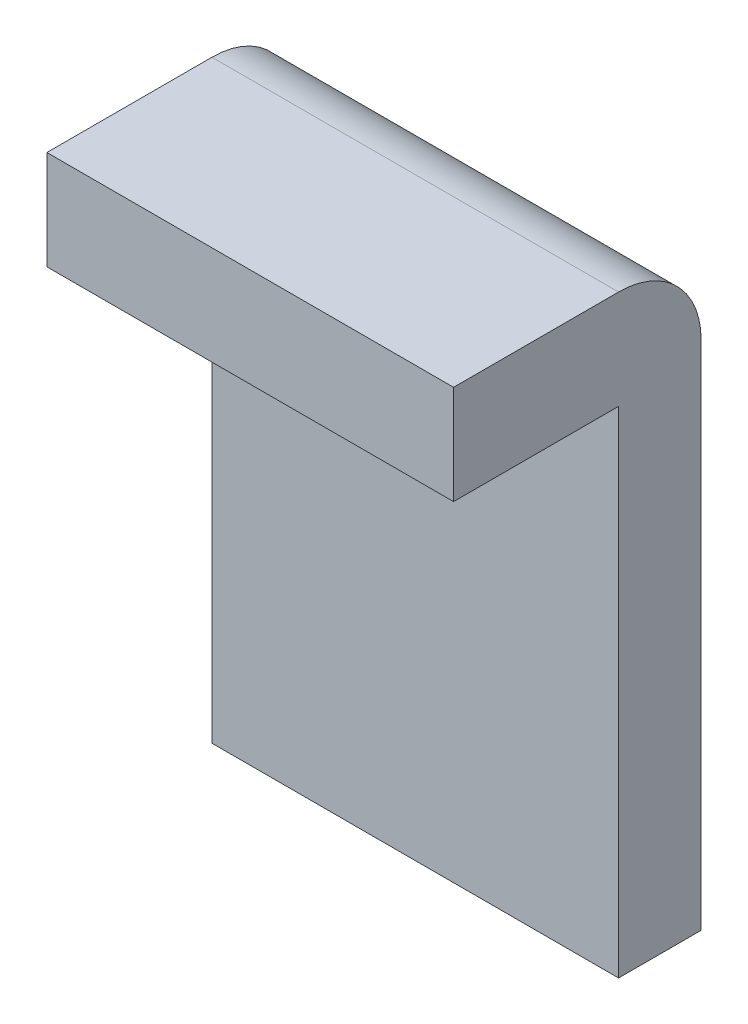
ISO-10303-21;
HEADER;
FILE_DESCRIPTION(('STEP AP214'),'2;1');
FILE_NAME('part.step','',(''),(''),'','','');
FILE_SCHEMA(('AUTOMOTIVE_DESIGN { 1 0 10303 214 1 1 1 1 }'));
ENDSEC;
DATA;
#1=APPLICATION_CONTEXT('core data for automotive mechanical design processes');
#2=APPLICATION_PROTOCOL_DEFINITION('international standard','automotive_design',2000,#1);
#3=PRODUCT_CONTEXT('',#1,'mechanical');
#4=PRODUCT('Part','Part','',(#3));
#5=PRODUCT_RELATED_PRODUCT_CATEGORY('part','',(#4));
#6=PRODUCT_DEFINITION_FORMATION('','',#4);
#7=PRODUCT_DEFINITION_CONTEXT('part definition',#1,'design');
#8=PRODUCT_DEFINITION('design','',#6,#7);
#9=PRODUCT_DEFINITION_SHAPE('','',#8);
#10=(LENGTH_UNIT() NAMED_UNIT(*) SI_UNIT(.MILLI.,.METRE.));
#11=(NAMED_UNIT(*) PLANE_ANGLE_UNIT() SI_UNIT($,.RADIAN.));
#12=(NAMED_UNIT(*) SI_UNIT($,.STERADIAN.) SOLID_ANGLE_UNIT());
#13=UNCERTAINTY_MEASURE_WITH_UNIT(LENGTH_MEASURE(1.E-05),#10,'distance_accuracy_value','');
#14=(GEOMETRIC_REPRESENTATION_CONTEXT(3) GLOBAL_UNCERTAINTY_ASSIGNED_CONTEXT((#13)) GLOBAL_UNIT_ASSIGNED_CONTEXT((#10,
#11,#12)) REPRESENTATION_CONTEXT('',''));
#15=CARTESIAN_POINT('',(0.,0.,0.));
#16=DIRECTION('',(0.,0.,1.));
#17=DIRECTION('',(1.,0.,0.));
#18=AXIS2_PLACEMENT_3D('',#15,#16,#17);
#19=CARTESIAN_POINT('',(-8.34906661620967,8.30000000000001,4.25467377707551));
#20=DIRECTION('',(0.,1.,0.));
#21=DIRECTION('',(0.,0.,1.));
#22=AXIS2_PLACEMENT_3D('',#19,#20,#21);
#23=PLANE('',#22);
#24=DIRECTION('',(1.,0.,0.));
#25=VECTOR('',#24,1.);
#26=CARTESIAN_POINT('',(16.6909354919998,8.30000000000001,4.25467377707551));
#27=LINE('',#26,#25);
#28=CARTESIAN_POINT('',(16.6909354919998,8.30000000000001,4.25467377707551));
#29=VERTEX_POINT('',#28);
#30=CARTESIAN_POINT('',(17.9230862484405,8.30000000000001,4.25467377707551));
#31=VERTEX_POINT('',#30);
#32=EDGE_CURVE('E133',#29,#31,#27,.T.);
#33=ORIENTED_EDGE('',*,*,#32,.F.);
#34=DIRECTION('',(0.,0.,1.));
#35=VECTOR('',#34,1.);
#36=CARTESIAN_POINT('',(16.6909354919998,8.30000000000001,4.25467377707552));
#37=LINE('',#36,#35);
#38=CARTESIAN_POINT('',(16.6909354919998,8.30000000000001,3.75467377707551));
#39=VERTEX_POINT('',#38);
#40=EDGE_CURVE('E113',#39,#29,#37,.T.);
#41=ORIENTED_EDGE('',*,*,#40,.F.);
#42=DIRECTION('',(1.,0.,0.));
#43=VECTOR('',#42,1.);
#44=CARTESIAN_POINT('',(-8.34906661620967,8.30000000000001,3.75467377707551));
#45=LINE('',#44,#43);
#46=CARTESIAN_POINT('',(17.9230862484405,8.30000000000001,3.75467377707551));
#47=VERTEX_POINT('',#46);
#48=EDGE_CURVE('E130',#39,#47,#45,.T.);
#49=ORIENTED_EDGE('',*,*,#48,.T.);
#50=DIRECTION('',(0.,0.,-1.));
#51=VECTOR('',#50,1.);
#52=CARTESIAN_POINT('',(17.9230862484405,8.30000000000001,4.25467377707552));
#53=LINE('',#52,#51);
#54=EDGE_CURVE('E129',#31,#47,#53,.T.);
#55=ORIENTED_EDGE('',*,*,#54,.F.);
#56=EDGE_LOOP('',(#33,#41,#49,#55));
#57=FACE_BOUND('',#56,.T.);
#58=ADVANCED_FACE('F17',(#57),#23,.F.);
#59=CARTESIAN_POINT('',(16.6909354919998,5.35753839337144,4.25467377707552));
#60=DIRECTION('',(0.,0.,1.));
#61=DIRECTION('',(0.,-1.,0.));
#62=AXIS2_PLACEMENT_3D('',#59,#60,#61);
#63=PLANE('',#62);
#64=DIRECTION('',(1.,0.,0.));
#65=VECTOR('',#64,1.);
#66=CARTESIAN_POINT('',(-8.34906661620967,8.6,4.25467377707551));
#67=LINE('',#66,#65);
#68=CARTESIAN_POINT('',(17.9230862484405,8.6,4.25467377707551));
#69=VERTEX_POINT('',#68);
#70=CARTESIAN_POINT('',(16.6909354919998,8.6,4.25467377707551));
#71=VERTEX_POINT('',#70);
#72=EDGE_CURVE('E131',#69,#71,#67,.F.);
#73=ORIENTED_EDGE('',*,*,#72,.T.);
#74=DIRECTION('',(0.,1.,0.));
#75=VECTOR('',#74,1.);
#76=CARTESIAN_POINT('',(16.6909354919998,5.35753839337144,4.25467377707551));
#77=LINE('',#76,#75);
#78=EDGE_CURVE('E136',#29,#71,#77,.T.);
#79=ORIENTED_EDGE('',*,*,#78,.F.);
#80=ORIENTED_EDGE('',*,*,#32,.T.);
#81=DIRECTION('',(0.,1.,0.));
#82=VECTOR('',#81,1.);
#83=CARTESIAN_POINT('',(17.9230862484405,5.35753839337144,4.25467377707551));
#84=LINE('',#83,#82);
#85=EDGE_CURVE('E120',#69,#31,#84,.F.);
#86=ORIENTED_EDGE('',*,*,#85,.F.);
#87=EDGE_LOOP('',(#73,#79,#80,#86));
#88=FACE_BOUND('',#87,.T.);
#89=ADVANCED_FACE('F172',(#88),#63,.T.);
#90=CARTESIAN_POINT('',(-8.34906661620967,8.6,4.25467377707551));
#91=DIRECTION('',(0.,-1.,0.));
#92=DIRECTION('',(0.,0.,-1.));
#93=AXIS2_PLACEMENT_3D('',#90,#91,#92);
#94=PLANE('',#93);
#95=DIRECTION('',(1.,0.,0.));
#96=VECTOR('',#95,1.);
#97=CARTESIAN_POINT('',(-8.34906661620967,8.6,3.75467377707551));
#98=LINE('',#97,#96);
#99=CARTESIAN_POINT('',(16.6909354919998,8.6,3.7546737770755));
#100=VERTEX_POINT('',#99);
#101=CARTESIAN_POINT('',(17.9230862484405,8.6,3.7546737770755));
#102=VERTEX_POINT('',#101);
#103=EDGE_CURVE('E79',#100,#102,#98,.T.);
#104=ORIENTED_EDGE('',*,*,#103,.F.);
#105=DIRECTION('',(0.,0.,1.));
#106=VECTOR('',#105,1.);
#107=CARTESIAN_POINT('',(16.6909354919998,8.6,4.25467377707552));
#108=LINE('',#107,#106);
#109=EDGE_CURVE('E139',#71,#100,#108,.F.);
#110=ORIENTED_EDGE('',*,*,#109,.F.);
#111=ORIENTED_EDGE('',*,*,#72,.F.);
#112=DIRECTION('',(0.,0.,-1.));
#113=VECTOR('',#112,1.);
#114=CARTESIAN_POINT('',(17.9230862484405,8.6,4.25467377707552));
#115=LINE('',#114,#113);
#116=EDGE_CURVE('E83',#102,#69,#115,.F.);
#117=ORIENTED_EDGE('',*,*,#116,.F.);
#118=EDGE_LOOP('',(#104,#110,#111,#117));
#119=FACE_BOUND('',#118,.T.);
#120=ADVANCED_FACE('F169',(#119),#94,.F.);
#121=CARTESIAN_POINT('',(-8.34906661620967,8.30000000000001,3.75467377707551));
#122=DIRECTION('',(0.,0.,-1.));
#123=DIRECTION('',(0.,1.,0.));
#124=AXIS2_PLACEMENT_3D('',#121,#122,#123);
#125=PLANE('',#124);
#126=ORIENTED_EDGE('',*,*,#48,.F.);
#127=DIRECTION('',(0.,1.,0.));
#128=VECTOR('',#127,1.);
#129=CARTESIAN_POINT('',(16.6909354919998,5.35753839337144,3.75467377707551));
#130=LINE('',#129,#128);
#131=CARTESIAN_POINT('',(16.6909354919998,6.8,3.75467377707551));
#132=VERTEX_POINT('',#131);
#133=EDGE_CURVE('E95',#132,#39,#130,.T.);
#134=ORIENTED_EDGE('',*,*,#133,.F.);
#135=DIRECTION('',(1.,0.,0.));
#136=VECTOR('',#135,1.);
#137=CARTESIAN_POINT('',(-15.8147962412963,6.8,3.75467377707551));
#138=LINE('',#137,#136);
#139=CARTESIAN_POINT('',(17.9230862484405,6.8,3.75467377707551));
#140=VERTEX_POINT('',#139);
#141=EDGE_CURVE('E114',#140,#132,#138,.F.);
#142=ORIENTED_EDGE('',*,*,#141,.F.);
#143=DIRECTION('',(0.,1.,0.));
#144=VECTOR('',#143,1.);
#145=CARTESIAN_POINT('',(17.9230862484405,5.35753839337144,3.75467377707551));
#146=LINE('',#145,#144);
#147=EDGE_CURVE('E84',#47,#140,#146,.F.);
#148=ORIENTED_EDGE('',*,*,#147,.F.);
#149=EDGE_LOOP('',(#126,#134,#142,#148));
#150=FACE_BOUND('',#149,.T.);
#151=ADVANCED_FACE('F178',(#150),#125,.F.);
#152=CARTESIAN_POINT('',(-8.34906661620967,8.35,3.7546737770755));
#153=DIRECTION('',(1.,0.,0.));
#154=DIRECTION('',(0.,0.,-1.));
#155=AXIS2_PLACEMENT_3D('',#152,#153,#154);
#156=CYLINDRICAL_SURFACE('',#155,0.249999999999996);
#157=CARTESIAN_POINT('',(16.6909354919997,8.35,3.7546737770755));
#158=DIRECTION('',(1.,0.,0.));
#159=DIRECTION('',(0.,0.,-1.));
#160=AXIS2_PLACEMENT_3D('',#157,#158,#159);
#161=CIRCLE('',#160,0.249999999999996);
#162=CARTESIAN_POINT('',(16.6909354919998,8.35,3.50467377707551));
#163=VERTEX_POINT('',#162);
#164=EDGE_CURVE('E106',#100,#163,#161,.F.);
#165=ORIENTED_EDGE('',*,*,#164,.F.);
#166=ORIENTED_EDGE('',*,*,#103,.T.);
#167=CARTESIAN_POINT('',(17.9230862484405,8.35,3.7546737770755));
#168=DIRECTION('',(1.,0.,0.));
#169=DIRECTION('',(0.,0.,-1.));
#170=AXIS2_PLACEMENT_3D('',#167,#168,#169);
#171=CIRCLE('',#170,0.249999999999996);
#172=CARTESIAN_POINT('',(17.9230862484405,8.35,3.50467377707551));
#173=VERTEX_POINT('',#172);
#174=EDGE_CURVE('E20',#173,#102,#171,.T.);
#175=ORIENTED_EDGE('',*,*,#174,.F.);
#176=DIRECTION('',(1.,0.,0.));
#177=VECTOR('',#176,1.);
#178=CARTESIAN_POINT('',(16.6909354919998,8.35,3.50467377707551));
#179=LINE('',#178,#177);
#180=EDGE_CURVE('E77',#163,#173,#179,.T.);
#181=ORIENTED_EDGE('',*,*,#180,.F.);
#182=EDGE_LOOP('',(#165,#166,#175,#181));
#183=FACE_BOUND('',#182,.T.);
#184=ADVANCED_FACE('F75',(#183),#156,.T.);
#185=CARTESIAN_POINT('',(17.9230862484405,5.35753839337144,4.25467377707552));
#186=DIRECTION('',(1.,0.,0.));
#187=DIRECTION('',(0.,0.,-1.));
#188=AXIS2_PLACEMENT_3D('',#185,#186,#187);
#189=PLANE('',#188);
#190=ORIENTED_EDGE('',*,*,#116,.T.);
#191=ORIENTED_EDGE('',*,*,#85,.T.);
#192=ORIENTED_EDGE('',*,*,#54,.T.);
#193=ORIENTED_EDGE('',*,*,#147,.T.);
#194=DIRECTION('',(0.,0.,-1.));
#195=VECTOR('',#194,1.);
#196=CARTESIAN_POINT('',(17.9230862484405,6.80000000000003,12.5046737770755));
#197=LINE('',#196,#195);
#198=CARTESIAN_POINT('',(17.9230862484405,6.8,3.50467377707552));
#199=VERTEX_POINT('',#198);
#200=EDGE_CURVE('E90',#199,#140,#197,.F.);
#201=ORIENTED_EDGE('',*,*,#200,.F.);
#202=DIRECTION('',(0.,1.,0.));
#203=VECTOR('',#202,1.);
#204=CARTESIAN_POINT('',(17.9230862484405,5.35753839337143,3.50467377707552));
#205=LINE('',#204,#203);
#206=EDGE_CURVE('E86',#173,#199,#205,.F.);
#207=ORIENTED_EDGE('',*,*,#206,.F.);
#208=ORIENTED_EDGE('',*,*,#174,.T.);
#209=EDGE_LOOP('',(#190,#191,#192,#193,#201,#207,#208));
#210=FACE_BOUND('',#209,.T.);
#211=ADVANCED_FACE('F87',(#210),#189,.T.);
#212=CARTESIAN_POINT('',(-15.8147962412963,6.80000000000003,12.5046737770755));
#213=DIRECTION('',(0.,-1.,0.));
#214=DIRECTION('',(0.,0.,-1.));
#215=AXIS2_PLACEMENT_3D('',#212,#213,#214);
#216=PLANE('',#215);
#217=DIRECTION('',(1.,0.,0.));
#218=VECTOR('',#217,1.);
#219=CARTESIAN_POINT('',(16.6909354919998,6.8,3.50467377707552));
#220=LINE('',#219,#218);
#221=CARTESIAN_POINT('',(16.6909354919998,6.8,3.50467377707552));
#222=VERTEX_POINT('',#221);
#223=EDGE_CURVE('E26',#199,#222,#220,.F.);
#224=ORIENTED_EDGE('',*,*,#223,.F.);
#225=ORIENTED_EDGE('',*,*,#200,.T.);
#226=ORIENTED_EDGE('',*,*,#141,.T.);
#227=DIRECTION('',(0.,0.,1.));
#228=VECTOR('',#227,1.);
#229=CARTESIAN_POINT('',(16.6909354919998,6.8,4.25467377707552));
#230=LINE('',#229,#228);
#231=EDGE_CURVE('E35',#222,#132,#230,.T.);
#232=ORIENTED_EDGE('',*,*,#231,.F.);
#233=EDGE_LOOP('',(#224,#225,#226,#232));
#234=FACE_BOUND('',#233,.T.);
#235=ADVANCED_FACE('F179',(#234),#216,.T.);
#236=CARTESIAN_POINT('',(16.6909354919998,5.35753839337144,4.25467377707552));
#237=DIRECTION('',(-1.,0.,0.));
#238=DIRECTION('',(0.,0.,1.));
#239=AXIS2_PLACEMENT_3D('',#236,#237,#238);
#240=PLANE('',#239);
#241=ORIENTED_EDGE('',*,*,#231,.T.);
#242=ORIENTED_EDGE('',*,*,#133,.T.);
#243=ORIENTED_EDGE('',*,*,#40,.T.);
#244=ORIENTED_EDGE('',*,*,#78,.T.);
#245=ORIENTED_EDGE('',*,*,#109,.T.);
#246=ORIENTED_EDGE('',*,*,#164,.T.);
#247=DIRECTION('',(0.,1.,0.));
#248=VECTOR('',#247,1.);
#249=CARTESIAN_POINT('',(16.6909354919998,5.35753839337143,3.50467377707552));
#250=LINE('',#249,#248);
#251=EDGE_CURVE('E11',#222,#163,#250,.T.);
#252=ORIENTED_EDGE('',*,*,#251,.F.);
#253=EDGE_LOOP('',(#241,#242,#243,#244,#245,#246,#252));
#254=FACE_BOUND('',#253,.T.);
#255=ADVANCED_FACE('F166',(#254),#240,.T.);
#256=CARTESIAN_POINT('',(16.6909354919998,5.35753839337143,3.50467377707552));
#257=DIRECTION('',(0.,0.,-1.));
#258=DIRECTION('',(0.,1.,0.));
#259=AXIS2_PLACEMENT_3D('',#256,#257,#258);
#260=PLANE('',#259);
#261=ORIENTED_EDGE('',*,*,#223,.T.);
#262=ORIENTED_EDGE('',*,*,#251,.T.);
#263=ORIENTED_EDGE('',*,*,#180,.T.);
#264=ORIENTED_EDGE('',*,*,#206,.T.);
#265=EDGE_LOOP('',(#261,#262,#263,#264));
#266=FACE_BOUND('',#265,.T.);
#267=ADVANCED_FACE('F94',(#266),#260,.T.);
#268=CLOSED_SHELL('',(#58,#89,#120,#151,#184,#211,#235,#255,#267));
#269=MANIFOLD_SOLID_BREP('B1',#268);
#270=ADVANCED_BREP_SHAPE_REPRESENTATION('',(#18,#269),#14);
#271=SHAPE_DEFINITION_REPRESENTATION(#9,#270);
ENDSEC;
END-ISO-10303-21;
